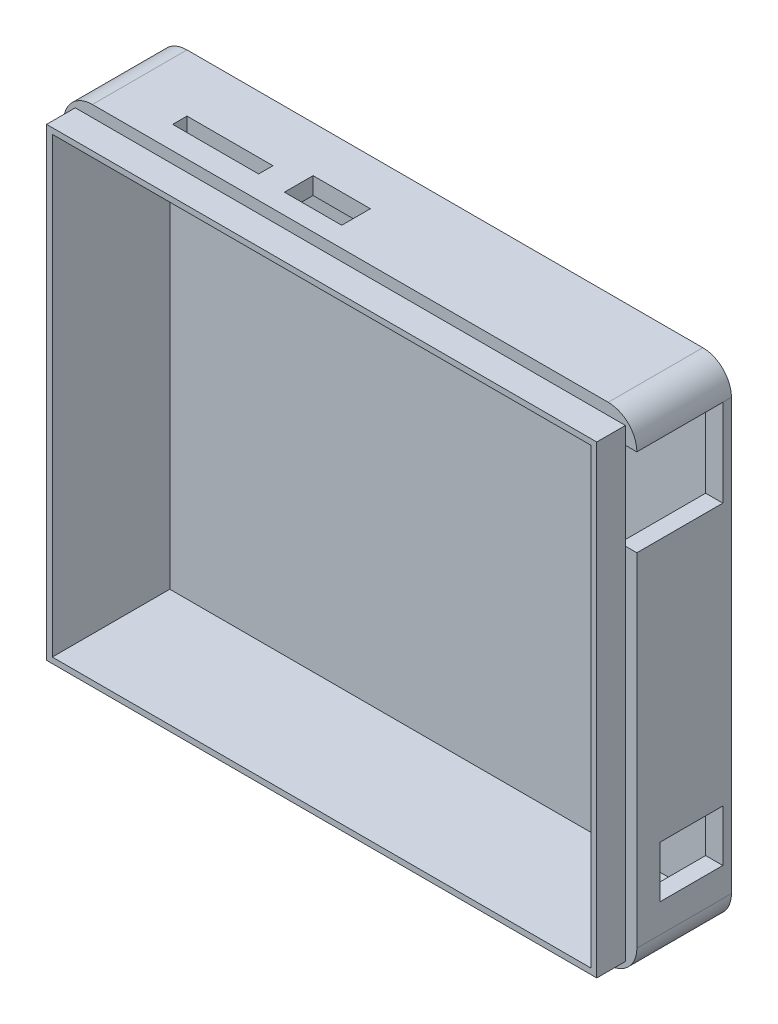
ISO-10303-21;
HEADER;
FILE_DESCRIPTION(('STEP AP214'),'2;1');
FILE_NAME('part.step','',(''),(''),'','','');
FILE_SCHEMA(('AUTOMOTIVE_DESIGN { 1 0 10303 214 1 1 1 1 }'));
ENDSEC;
DATA;
#1=APPLICATION_CONTEXT('core data for automotive mechanical design processes');
#2=APPLICATION_PROTOCOL_DEFINITION('international standard','automotive_design',2000,#1);
#3=PRODUCT_CONTEXT('',#1,'mechanical');
#4=PRODUCT('Part','Part','',(#3));
#5=PRODUCT_RELATED_PRODUCT_CATEGORY('part','',(#4));
#6=PRODUCT_DEFINITION_FORMATION('','',#4);
#7=PRODUCT_DEFINITION_CONTEXT('part definition',#1,'design');
#8=PRODUCT_DEFINITION('design','',#6,#7);
#9=PRODUCT_DEFINITION_SHAPE('','',#8);
#10=(LENGTH_UNIT() NAMED_UNIT(*) SI_UNIT(.MILLI.,.METRE.));
#11=(NAMED_UNIT(*) PLANE_ANGLE_UNIT() SI_UNIT($,.RADIAN.));
#12=(NAMED_UNIT(*) SI_UNIT($,.STERADIAN.) SOLID_ANGLE_UNIT());
#13=UNCERTAINTY_MEASURE_WITH_UNIT(LENGTH_MEASURE(1.E-05),#10,'distance_accuracy_value','');
#14=(GEOMETRIC_REPRESENTATION_CONTEXT(3) GLOBAL_UNCERTAINTY_ASSIGNED_CONTEXT((#13)) GLOBAL_UNIT_ASSIGNED_CONTEXT((#10,
#11,#12)) REPRESENTATION_CONTEXT('',''));
#15=CARTESIAN_POINT('',(0.,0.,0.));
#16=DIRECTION('',(0.,0.,1.));
#17=DIRECTION('',(1.,0.,0.));
#18=AXIS2_PLACEMENT_3D('',#15,#16,#17);
#19=CARTESIAN_POINT('',(50.,42.5,20.));
#20=DIRECTION('',(-1.,0.,0.));
#21=DIRECTION('',(0.,-1.,0.));
#22=AXIS2_PLACEMENT_3D('',#19,#20,#21);
#23=PLANE('',#22);
#24=DIRECTION('',(0.,0.,1.));
#25=VECTOR('',#24,1.);
#26=CARTESIAN_POINT('',(50.,-23.5,11.));
#27=LINE('',#26,#25);
#28=CARTESIAN_POINT('',(50.,-23.5,0.));
#29=VERTEX_POINT('',#28);
#30=CARTESIAN_POINT('',(50.,-23.5,11.));
#31=VERTEX_POINT('',#30);
#32=EDGE_CURVE('E326',#29,#31,#27,.T.);
#33=ORIENTED_EDGE('',*,*,#32,.F.);
#34=DIRECTION('',(0.,1.,0.));
#35=VECTOR('',#34,1.);
#36=CARTESIAN_POINT('',(50.,-23.5,0.));
#37=LINE('',#36,#35);
#38=CARTESIAN_POINT('',(50.,-32.5,0.));
#39=VERTEX_POINT('',#38);
#40=EDGE_CURVE('E324',#39,#29,#37,.T.);
#41=ORIENTED_EDGE('',*,*,#40,.F.);
#42=DIRECTION('',(0.,0.,-1.));
#43=VECTOR('',#42,1.);
#44=CARTESIAN_POINT('',(50.,-32.5,11.));
#45=LINE('',#44,#43);
#46=CARTESIAN_POINT('',(50.,-32.5,11.));
#47=VERTEX_POINT('',#46);
#48=EDGE_CURVE('E332',#47,#39,#45,.T.);
#49=ORIENTED_EDGE('',*,*,#48,.F.);
#50=DIRECTION('',(0.,-1.,0.));
#51=VECTOR('',#50,1.);
#52=CARTESIAN_POINT('',(50.,-23.5,11.));
#53=LINE('',#52,#51);
#54=EDGE_CURVE('E329',#31,#47,#53,.T.);
#55=ORIENTED_EDGE('',*,*,#54,.F.);
#56=EDGE_LOOP('',(#33,#41,#49,#55));
#57=FACE_BOUND('',#56,.T.);
#58=DIRECTION('',(0.,-1.,0.));
#59=VECTOR('',#58,1.);
#60=CARTESIAN_POINT('',(50.,42.5,-1.5));
#61=LINE('',#60,#59);
#62=CARTESIAN_POINT('',(50.,37.5,-1.5));
#63=VERTEX_POINT('',#62);
#64=CARTESIAN_POINT('',(50.,-37.5,-1.5));
#65=VERTEX_POINT('',#64);
#66=EDGE_CURVE('E362',#63,#65,#61,.T.);
#67=ORIENTED_EDGE('',*,*,#66,.F.);
#68=DIRECTION('',(0.,0.,-1.));
#69=VECTOR('',#68,1.);
#70=CARTESIAN_POINT('',(50.,37.5,20.));
#71=LINE('',#70,#69);
#72=CARTESIAN_POINT('',(50.,37.5,0.));
#73=VERTEX_POINT('',#72);
#74=EDGE_CURVE('E11',#63,#73,#71,.F.);
#75=ORIENTED_EDGE('',*,*,#74,.T.);
#76=DIRECTION('',(0.,1.,0.));
#77=VECTOR('',#76,1.);
#78=CARTESIAN_POINT('',(50.,37.5,0.));
#79=LINE('',#78,#77);
#80=CARTESIAN_POINT('',(50.,22.26,0.));
#81=VERTEX_POINT('',#80);
#82=EDGE_CURVE('E295',#81,#73,#79,.T.);
#83=ORIENTED_EDGE('',*,*,#82,.F.);
#84=DIRECTION('',(0.,0.,-1.));
#85=VECTOR('',#84,1.);
#86=CARTESIAN_POINT('',(50.,22.26,15.));
#87=LINE('',#86,#85);
#88=CARTESIAN_POINT('',(50.,22.26,15.));
#89=VERTEX_POINT('',#88);
#90=EDGE_CURVE('E306',#89,#81,#87,.T.);
#91=ORIENTED_EDGE('',*,*,#90,.F.);
#92=DIRECTION('',(0.,1.,0.));
#93=VECTOR('',#92,1.);
#94=CARTESIAN_POINT('',(50.,-42.5,15.));
#95=LINE('',#94,#93);
#96=CARTESIAN_POINT('',(50.,-37.5,15.));
#97=VERTEX_POINT('',#96);
#98=EDGE_CURVE('E416',#97,#89,#95,.T.);
#99=ORIENTED_EDGE('',*,*,#98,.F.);
#100=DIRECTION('',(0.,0.,-1.));
#101=VECTOR('',#100,1.);
#102=CARTESIAN_POINT('',(50.,-37.5,20.));
#103=LINE('',#102,#101);
#104=EDGE_CURVE('E41',#97,#65,#103,.T.);
#105=ORIENTED_EDGE('',*,*,#104,.T.);
#106=EDGE_LOOP('',(#67,#75,#83,#91,#99,#105));
#107=FACE_BOUND('',#106,.T.);
#108=ADVANCED_FACE('F33',(#57,#107),#23,.F.);
#109=CARTESIAN_POINT('',(-50.,42.5,20.));
#110=DIRECTION('',(0.,-1.,0.));
#111=DIRECTION('',(0.,0.,-1.));
#112=AXIS2_PLACEMENT_3D('',#109,#110,#111);
#113=PLANE('',#112);
#114=DIRECTION('',(-1.,0.,0.));
#115=VECTOR('',#114,1.);
#116=CARTESIAN_POINT('',(-15.,42.5,6.5));
#117=LINE('',#116,#115);
#118=CARTESIAN_POINT('',(-5.,42.5,6.5));
#119=VERTEX_POINT('',#118);
#120=CARTESIAN_POINT('',(-15.,42.5,6.5));
#121=VERTEX_POINT('',#120);
#122=EDGE_CURVE('E262',#119,#121,#117,.T.);
#123=ORIENTED_EDGE('',*,*,#122,.F.);
#124=DIRECTION('',(0.,0.,-1.));
#125=VECTOR('',#124,1.);
#126=CARTESIAN_POINT('',(-4.99999999999999,42.5,6.5));
#127=LINE('',#126,#125);
#128=CARTESIAN_POINT('',(-4.99999999999999,42.5,11.5));
#129=VERTEX_POINT('',#128);
#130=EDGE_CURVE('E267',#129,#119,#127,.T.);
#131=ORIENTED_EDGE('',*,*,#130,.F.);
#132=DIRECTION('',(1.,0.,0.));
#133=VECTOR('',#132,1.);
#134=CARTESIAN_POINT('',(-15.,42.5,11.5));
#135=LINE('',#134,#133);
#136=CARTESIAN_POINT('',(-15.,42.5,11.5));
#137=VERTEX_POINT('',#136);
#138=EDGE_CURVE('E272',#137,#129,#135,.T.);
#139=ORIENTED_EDGE('',*,*,#138,.F.);
#140=DIRECTION('',(0.,0.,1.));
#141=VECTOR('',#140,1.);
#142=CARTESIAN_POINT('',(-15.,42.5,6.5));
#143=LINE('',#142,#141);
#144=EDGE_CURVE('E251',#121,#137,#143,.T.);
#145=ORIENTED_EDGE('',*,*,#144,.F.);
#146=EDGE_LOOP('',(#123,#131,#139,#145));
#147=FACE_BOUND('',#146,.T.);
#148=DIRECTION('',(-1.,0.,0.));
#149=VECTOR('',#148,1.);
#150=CARTESIAN_POINT('',(-35.,42.5,8.5));
#151=LINE('',#150,#149);
#152=CARTESIAN_POINT('',(-20.,42.5,8.5));
#153=VERTEX_POINT('',#152);
#154=CARTESIAN_POINT('',(-35.,42.5,8.5));
#155=VERTEX_POINT('',#154);
#156=EDGE_CURVE('E283',#153,#155,#151,.T.);
#157=ORIENTED_EDGE('',*,*,#156,.F.);
#158=DIRECTION('',(0.,0.,-1.));
#159=VECTOR('',#158,1.);
#160=CARTESIAN_POINT('',(-20.,42.5,8.5));
#161=LINE('',#160,#159);
#162=CARTESIAN_POINT('',(-20.,42.5,11.));
#163=VERTEX_POINT('',#162);
#164=EDGE_CURVE('E279',#163,#153,#161,.T.);
#165=ORIENTED_EDGE('',*,*,#164,.F.);
#166=DIRECTION('',(1.,0.,0.));
#167=VECTOR('',#166,1.);
#168=CARTESIAN_POINT('',(-35.,42.5,11.));
#169=LINE('',#168,#167);
#170=CARTESIAN_POINT('',(-35.,42.5,11.));
#171=VERTEX_POINT('',#170);
#172=EDGE_CURVE('E289',#171,#163,#169,.T.);
#173=ORIENTED_EDGE('',*,*,#172,.F.);
#174=DIRECTION('',(0.,0.,1.));
#175=VECTOR('',#174,1.);
#176=CARTESIAN_POINT('',(-35.,42.5,8.5));
#177=LINE('',#176,#175);
#178=EDGE_CURVE('E286',#155,#171,#177,.T.);
#179=ORIENTED_EDGE('',*,*,#178,.F.);
#180=EDGE_LOOP('',(#157,#165,#173,#179));
#181=FACE_BOUND('',#180,.T.);
#182=DIRECTION('',(1.,0.,0.));
#183=VECTOR('',#182,1.);
#184=CARTESIAN_POINT('',(50.,42.5,-1.5));
#185=LINE('',#184,#183);
#186=CARTESIAN_POINT('',(-45.,42.5,-1.5));
#187=VERTEX_POINT('',#186);
#188=CARTESIAN_POINT('',(45.,42.5,-1.5));
#189=VERTEX_POINT('',#188);
#190=EDGE_CURVE('E359',#187,#189,#185,.T.);
#191=ORIENTED_EDGE('',*,*,#190,.F.);
#192=DIRECTION('',(0.,0.,-1.));
#193=VECTOR('',#192,1.);
#194=CARTESIAN_POINT('',(-45.,42.5,20.));
#195=LINE('',#194,#193);
#196=CARTESIAN_POINT('',(-45.,42.5,15.));
#197=VERTEX_POINT('',#196);
#198=EDGE_CURVE('E492',#187,#197,#195,.F.);
#199=ORIENTED_EDGE('',*,*,#198,.T.);
#200=DIRECTION('',(-1.,0.,0.));
#201=VECTOR('',#200,1.);
#202=CARTESIAN_POINT('',(-50.,42.5,15.));
#203=LINE('',#202,#201);
#204=CARTESIAN_POINT('',(45.,42.5,15.));
#205=VERTEX_POINT('',#204);
#206=EDGE_CURVE('E424',#205,#197,#203,.T.);
#207=ORIENTED_EDGE('',*,*,#206,.F.);
#208=DIRECTION('',(0.,0.,-1.));
#209=VECTOR('',#208,1.);
#210=CARTESIAN_POINT('',(45.,42.5,20.));
#211=LINE('',#210,#209);
#212=EDGE_CURVE('E489',#205,#189,#211,.T.);
#213=ORIENTED_EDGE('',*,*,#212,.T.);
#214=EDGE_LOOP('',(#191,#199,#207,#213));
#215=FACE_BOUND('',#214,.T.);
#216=ADVANCED_FACE('F269',(#147,#181,#215),#113,.F.);
#217=CARTESIAN_POINT('',(-50.,42.5,20.));
#218=DIRECTION('',(1.,0.,0.));
#219=DIRECTION('',(0.,1.,0.));
#220=AXIS2_PLACEMENT_3D('',#217,#218,#219);
#221=PLANE('',#220);
#222=DIRECTION('',(0.,-1.,0.));
#223=VECTOR('',#222,1.);
#224=CARTESIAN_POINT('',(-50.,-42.5,15.));
#225=LINE('',#224,#223);
#226=CARTESIAN_POINT('',(-50.,37.5,15.));
#227=VERTEX_POINT('',#226);
#228=CARTESIAN_POINT('',(-50.,-37.5,15.));
#229=VERTEX_POINT('',#228);
#230=EDGE_CURVE('E427',#227,#229,#225,.T.);
#231=ORIENTED_EDGE('',*,*,#230,.F.);
#232=DIRECTION('',(0.,0.,-1.));
#233=VECTOR('',#232,1.);
#234=CARTESIAN_POINT('',(-50.,37.5,20.));
#235=LINE('',#234,#233);
#236=CARTESIAN_POINT('',(-50.,37.5,-1.5));
#237=VERTEX_POINT('',#236);
#238=EDGE_CURVE('E478',#227,#237,#235,.T.);
#239=ORIENTED_EDGE('',*,*,#238,.T.);
#240=DIRECTION('',(0.,1.,0.));
#241=VECTOR('',#240,1.);
#242=CARTESIAN_POINT('',(-50.,42.5,-1.5));
#243=LINE('',#242,#241);
#244=CARTESIAN_POINT('',(-50.,-37.5,-1.5));
#245=VERTEX_POINT('',#244);
#246=EDGE_CURVE('E356',#245,#237,#243,.T.);
#247=ORIENTED_EDGE('',*,*,#246,.F.);
#248=DIRECTION('',(0.,0.,-1.));
#249=VECTOR('',#248,1.);
#250=CARTESIAN_POINT('',(-50.,-37.5,20.));
#251=LINE('',#250,#249);
#252=EDGE_CURVE('E476',#245,#229,#251,.F.);
#253=ORIENTED_EDGE('',*,*,#252,.T.);
#254=EDGE_LOOP('',(#231,#239,#247,#253));
#255=FACE_BOUND('',#254,.T.);
#256=ADVANCED_FACE('F532',(#255),#221,.F.);
#257=CARTESIAN_POINT('',(-50.,-42.5,20.));
#258=DIRECTION('',(0.,1.,0.));
#259=DIRECTION('',(0.,0.,1.));
#260=AXIS2_PLACEMENT_3D('',#257,#258,#259);
#261=PLANE('',#260);
#262=DIRECTION('',(1.,0.,0.));
#263=VECTOR('',#262,1.);
#264=CARTESIAN_POINT('',(-50.,-42.5,15.));
#265=LINE('',#264,#263);
#266=CARTESIAN_POINT('',(-45.,-42.5,15.));
#267=VERTEX_POINT('',#266);
#268=CARTESIAN_POINT('',(45.,-42.5,15.));
#269=VERTEX_POINT('',#268);
#270=EDGE_CURVE('E429',#267,#269,#265,.T.);
#271=ORIENTED_EDGE('',*,*,#270,.F.);
#272=DIRECTION('',(0.,0.,-1.));
#273=VECTOR('',#272,1.);
#274=CARTESIAN_POINT('',(-45.,-42.5,20.));
#275=LINE('',#274,#273);
#276=CARTESIAN_POINT('',(-45.,-42.5,-1.5));
#277=VERTEX_POINT('',#276);
#278=EDGE_CURVE('E502',#267,#277,#275,.T.);
#279=ORIENTED_EDGE('',*,*,#278,.T.);
#280=DIRECTION('',(-1.,0.,0.));
#281=VECTOR('',#280,1.);
#282=CARTESIAN_POINT('',(50.,-42.5,-1.5));
#283=LINE('',#282,#281);
#284=CARTESIAN_POINT('',(45.,-42.5,-1.5));
#285=VERTEX_POINT('',#284);
#286=EDGE_CURVE('E365',#285,#277,#283,.T.);
#287=ORIENTED_EDGE('',*,*,#286,.F.);
#288=DIRECTION('',(0.,0.,-1.));
#289=VECTOR('',#288,1.);
#290=CARTESIAN_POINT('',(45.,-42.5,20.));
#291=LINE('',#290,#289);
#292=EDGE_CURVE('E48',#285,#269,#291,.F.);
#293=ORIENTED_EDGE('',*,*,#292,.T.);
#294=EDGE_LOOP('',(#271,#279,#287,#293));
#295=FACE_BOUND('',#294,.T.);
#296=ADVANCED_FACE('F537',(#295),#261,.F.);
#297=CARTESIAN_POINT('',(0.,0.,15.));
#298=DIRECTION('',(0.,0.,-1.));
#299=DIRECTION('',(-1.,0.,0.));
#300=AXIS2_PLACEMENT_3D('',#297,#298,#299);
#301=PLANE('',#300);
#302=ORIENTED_EDGE('',*,*,#206,.T.);
#303=CARTESIAN_POINT('',(-45.,37.5,15.));
#304=DIRECTION('',(0.,0.,-1.));
#305=DIRECTION('',(-1.,0.,0.));
#306=AXIS2_PLACEMENT_3D('',#303,#304,#305);
#307=CIRCLE('',#306,5.);
#308=EDGE_CURVE('E499',#197,#227,#307,.F.);
#309=ORIENTED_EDGE('',*,*,#308,.T.);
#310=ORIENTED_EDGE('',*,*,#230,.T.);
#311=CARTESIAN_POINT('',(-45.,-37.5,15.));
#312=DIRECTION('',(0.,0.,-1.));
#313=DIRECTION('',(-1.,0.,0.));
#314=AXIS2_PLACEMENT_3D('',#311,#312,#313);
#315=CIRCLE('',#314,5.);
#316=EDGE_CURVE('E55',#229,#267,#315,.F.);
#317=ORIENTED_EDGE('',*,*,#316,.T.);
#318=ORIENTED_EDGE('',*,*,#270,.T.);
#319=CARTESIAN_POINT('',(45.,-37.5,15.));
#320=DIRECTION('',(0.,0.,-1.));
#321=DIRECTION('',(-1.,0.,0.));
#322=AXIS2_PLACEMENT_3D('',#319,#320,#321);
#323=CIRCLE('',#322,5.);
#324=EDGE_CURVE('E494',#269,#97,#323,.F.);
#325=ORIENTED_EDGE('',*,*,#324,.T.);
#326=ORIENTED_EDGE('',*,*,#98,.T.);
#327=DIRECTION('',(1.,0.,0.));
#328=VECTOR('',#327,1.);
#329=CARTESIAN_POINT('',(0.,22.26,15.));
#330=LINE('',#329,#328);
#331=CARTESIAN_POINT('',(48.,22.26,15.));
#332=VERTEX_POINT('',#331);
#333=EDGE_CURVE('E314',#332,#89,#330,.T.);
#334=ORIENTED_EDGE('',*,*,#333,.F.);
#335=DIRECTION('',(0.,1.,0.));
#336=VECTOR('',#335,1.);
#337=CARTESIAN_POINT('',(48.,40.5,15.));
#338=LINE('',#337,#336);
#339=CARTESIAN_POINT('',(48.,-40.5,15.));
#340=VERTEX_POINT('',#339);
#341=EDGE_CURVE('E389',#340,#332,#338,.T.);
#342=ORIENTED_EDGE('',*,*,#341,.F.);
#343=DIRECTION('',(1.,0.,0.));
#344=VECTOR('',#343,1.);
#345=CARTESIAN_POINT('',(-48.,-40.5,15.));
#346=LINE('',#345,#344);
#347=CARTESIAN_POINT('',(-48.,-40.5,15.));
#348=VERTEX_POINT('',#347);
#349=EDGE_CURVE('E399',#348,#340,#346,.T.);
#350=ORIENTED_EDGE('',*,*,#349,.F.);
#351=DIRECTION('',(0.,-1.,0.));
#352=VECTOR('',#351,1.);
#353=CARTESIAN_POINT('',(-48.,40.5,15.));
#354=LINE('',#353,#352);
#355=CARTESIAN_POINT('',(-48.,40.5,15.));
#356=VERTEX_POINT('',#355);
#357=EDGE_CURVE('E396',#356,#348,#354,.T.);
#358=ORIENTED_EDGE('',*,*,#357,.F.);
#359=DIRECTION('',(-1.,0.,0.));
#360=VECTOR('',#359,1.);
#361=CARTESIAN_POINT('',(-48.,40.5,15.));
#362=LINE('',#361,#360);
#363=CARTESIAN_POINT('',(48.,40.5,15.));
#364=VERTEX_POINT('',#363);
#365=EDGE_CURVE('E392',#364,#356,#362,.T.);
#366=ORIENTED_EDGE('',*,*,#365,.F.);
#367=CARTESIAN_POINT('',(48.,37.5,15.));
#368=VERTEX_POINT('',#367);
#369=EDGE_CURVE('E393',#368,#364,#338,.T.);
#370=ORIENTED_EDGE('',*,*,#369,.F.);
#371=DIRECTION('',(1.,0.,0.));
#372=VECTOR('',#371,1.);
#373=CARTESIAN_POINT('',(0.,37.5,15.));
#374=LINE('',#373,#372);
#375=CARTESIAN_POINT('',(50.,37.5,15.));
#376=VERTEX_POINT('',#375);
#377=EDGE_CURVE('E318',#368,#376,#374,.T.);
#378=ORIENTED_EDGE('',*,*,#377,.T.);
#379=CARTESIAN_POINT('',(45.,37.5,15.));
#380=DIRECTION('',(0.,0.,-1.));
#381=DIRECTION('',(-1.,0.,0.));
#382=AXIS2_PLACEMENT_3D('',#379,#380,#381);
#383=CIRCLE('',#382,5.);
#384=EDGE_CURVE('E496',#376,#205,#383,.F.);
#385=ORIENTED_EDGE('',*,*,#384,.T.);
#386=EDGE_LOOP('',(#302,#309,#310,#317,#318,#325,#326,#334,#342,#350,#358,#366,#370,#378,#385));
#387=FACE_BOUND('',#386,.T.);
#388=ADVANCED_FACE('F525',(#387),#301,.F.);
#389=CARTESIAN_POINT('',(48.,40.5,15.));
#390=DIRECTION('',(1.,0.,0.));
#391=DIRECTION('',(0.,1.,0.));
#392=AXIS2_PLACEMENT_3D('',#389,#390,#391);
#393=PLANE('',#392);
#394=DIRECTION('',(0.,1.,0.));
#395=VECTOR('',#394,1.);
#396=CARTESIAN_POINT('',(48.,40.5,20.));
#397=LINE('',#396,#395);
#398=CARTESIAN_POINT('',(48.,-40.5,20.));
#399=VERTEX_POINT('',#398);
#400=CARTESIAN_POINT('',(48.,40.5,20.));
#401=VERTEX_POINT('',#400);
#402=EDGE_CURVE('E382',#399,#401,#397,.T.);
#403=ORIENTED_EDGE('',*,*,#402,.F.);
#404=DIRECTION('',(0.,0.,1.));
#405=VECTOR('',#404,1.);
#406=CARTESIAN_POINT('',(48.,-40.5,15.));
#407=LINE('',#406,#405);
#408=EDGE_CURVE('E414',#340,#399,#407,.T.);
#409=ORIENTED_EDGE('',*,*,#408,.F.);
#410=ORIENTED_EDGE('',*,*,#341,.T.);
#411=DIRECTION('',(0.,-1.,0.));
#412=VECTOR('',#411,1.);
#413=CARTESIAN_POINT('',(48.,40.5,15.));
#414=LINE('',#413,#412);
#415=EDGE_CURVE('E312',#368,#332,#414,.T.);
#416=ORIENTED_EDGE('',*,*,#415,.F.);
#417=ORIENTED_EDGE('',*,*,#369,.T.);
#418=DIRECTION('',(0.,0.,1.));
#419=VECTOR('',#418,1.);
#420=CARTESIAN_POINT('',(48.,40.5,15.));
#421=LINE('',#420,#419);
#422=EDGE_CURVE('E402',#364,#401,#421,.T.);
#423=ORIENTED_EDGE('',*,*,#422,.T.);
#424=EDGE_LOOP('',(#403,#409,#410,#416,#417,#423));
#425=FACE_BOUND('',#424,.T.);
#426=ADVANCED_FACE('F827',(#425),#393,.T.);
#427=CARTESIAN_POINT('',(-48.,-40.5,15.));
#428=DIRECTION('',(0.,-1.,0.));
#429=DIRECTION('',(0.,0.,-1.));
#430=AXIS2_PLACEMENT_3D('',#427,#428,#429);
#431=PLANE('',#430);
#432=DIRECTION('',(1.,0.,0.));
#433=VECTOR('',#432,1.);
#434=CARTESIAN_POINT('',(-48.,-40.5,20.));
#435=LINE('',#434,#433);
#436=CARTESIAN_POINT('',(-48.,-40.5,20.));
#437=VERTEX_POINT('',#436);
#438=EDGE_CURVE('E411',#437,#399,#435,.T.);
#439=ORIENTED_EDGE('',*,*,#438,.F.);
#440=DIRECTION('',(0.,0.,1.));
#441=VECTOR('',#440,1.);
#442=CARTESIAN_POINT('',(-48.,-40.5,15.));
#443=LINE('',#442,#441);
#444=EDGE_CURVE('E417',#348,#437,#443,.T.);
#445=ORIENTED_EDGE('',*,*,#444,.F.);
#446=ORIENTED_EDGE('',*,*,#349,.T.);
#447=ORIENTED_EDGE('',*,*,#408,.T.);
#448=EDGE_LOOP('',(#439,#445,#446,#447));
#449=FACE_BOUND('',#448,.T.);
#450=ADVANCED_FACE('F833',(#449),#431,.T.);
#451=CARTESIAN_POINT('',(-48.,40.5,15.));
#452=DIRECTION('',(-1.,0.,0.));
#453=DIRECTION('',(0.,-1.,0.));
#454=AXIS2_PLACEMENT_3D('',#451,#452,#453);
#455=PLANE('',#454);
#456=DIRECTION('',(0.,-1.,0.));
#457=VECTOR('',#456,1.);
#458=CARTESIAN_POINT('',(-48.,40.5,20.));
#459=LINE('',#458,#457);
#460=CARTESIAN_POINT('',(-48.,40.5,20.));
#461=VERTEX_POINT('',#460);
#462=EDGE_CURVE('E408',#461,#437,#459,.T.);
#463=ORIENTED_EDGE('',*,*,#462,.F.);
#464=DIRECTION('',(0.,0.,1.));
#465=VECTOR('',#464,1.);
#466=CARTESIAN_POINT('',(-48.,40.5,15.));
#467=LINE('',#466,#465);
#468=EDGE_CURVE('E419',#356,#461,#467,.T.);
#469=ORIENTED_EDGE('',*,*,#468,.F.);
#470=ORIENTED_EDGE('',*,*,#357,.T.);
#471=ORIENTED_EDGE('',*,*,#444,.T.);
#472=EDGE_LOOP('',(#463,#469,#470,#471));
#473=FACE_BOUND('',#472,.T.);
#474=ADVANCED_FACE('F841',(#473),#455,.T.);
#475=CARTESIAN_POINT('',(-48.,40.5,15.));
#476=DIRECTION('',(0.,1.,0.));
#477=DIRECTION('',(0.,0.,1.));
#478=AXIS2_PLACEMENT_3D('',#475,#476,#477);
#479=PLANE('',#478);
#480=DIRECTION('',(-1.,0.,0.));
#481=VECTOR('',#480,1.);
#482=CARTESIAN_POINT('',(-48.,40.5,20.));
#483=LINE('',#482,#481);
#484=EDGE_CURVE('E405',#401,#461,#483,.T.);
#485=ORIENTED_EDGE('',*,*,#484,.F.);
#486=ORIENTED_EDGE('',*,*,#422,.F.);
#487=ORIENTED_EDGE('',*,*,#365,.T.);
#488=ORIENTED_EDGE('',*,*,#468,.T.);
#489=EDGE_LOOP('',(#485,#486,#487,#488));
#490=FACE_BOUND('',#489,.T.);
#491=ADVANCED_FACE('F849',(#490),#479,.T.);
#492=CARTESIAN_POINT('',(0.,0.,20.));
#493=DIRECTION('',(0.,0.,1.));
#494=DIRECTION('',(1.,0.,0.));
#495=AXIS2_PLACEMENT_3D('',#492,#493,#494);
#496=PLANE('',#495);
#497=DIRECTION('',(0.,1.,0.));
#498=VECTOR('',#497,1.);
#499=CARTESIAN_POINT('',(47.,39.5,20.));
#500=LINE('',#499,#498);
#501=CARTESIAN_POINT('',(47.,-39.5,20.));
#502=VERTEX_POINT('',#501);
#503=CARTESIAN_POINT('',(47.,39.5,20.));
#504=VERTEX_POINT('',#503);
#505=EDGE_CURVE('E368',#502,#504,#500,.T.);
#506=ORIENTED_EDGE('',*,*,#505,.F.);
#507=DIRECTION('',(1.,0.,0.));
#508=VECTOR('',#507,1.);
#509=CARTESIAN_POINT('',(-47.,-39.5,20.));
#510=LINE('',#509,#508);
#511=CARTESIAN_POINT('',(-47.,-39.5,20.));
#512=VERTEX_POINT('',#511);
#513=EDGE_CURVE('E376',#512,#502,#510,.T.);
#514=ORIENTED_EDGE('',*,*,#513,.F.);
#515=DIRECTION('',(0.,-1.,0.));
#516=VECTOR('',#515,1.);
#517=CARTESIAN_POINT('',(-47.,39.5,20.));
#518=LINE('',#517,#516);
#519=CARTESIAN_POINT('',(-47.,39.5,20.));
#520=VERTEX_POINT('',#519);
#521=EDGE_CURVE('E373',#520,#512,#518,.T.);
#522=ORIENTED_EDGE('',*,*,#521,.F.);
#523=DIRECTION('',(-1.,0.,0.));
#524=VECTOR('',#523,1.);
#525=CARTESIAN_POINT('',(-47.,39.5,20.));
#526=LINE('',#525,#524);
#527=EDGE_CURVE('E370',#504,#520,#526,.T.);
#528=ORIENTED_EDGE('',*,*,#527,.F.);
#529=EDGE_LOOP('',(#506,#514,#522,#528));
#530=FACE_BOUND('',#529,.T.);
#531=ORIENTED_EDGE('',*,*,#438,.T.);
#532=ORIENTED_EDGE('',*,*,#402,.T.);
#533=ORIENTED_EDGE('',*,*,#484,.T.);
#534=ORIENTED_EDGE('',*,*,#462,.T.);
#535=EDGE_LOOP('',(#531,#532,#533,#534));
#536=FACE_BOUND('',#535,.T.);
#537=ADVANCED_FACE('F774',(#530,#536),#496,.T.);
#538=CARTESIAN_POINT('',(47.,39.5,1.));
#539=DIRECTION('',(1.,0.,0.));
#540=DIRECTION('',(0.,1.,0.));
#541=AXIS2_PLACEMENT_3D('',#538,#539,#540);
#542=PLANE('',#541);
#543=DIRECTION('',(0.,0.,-1.));
#544=VECTOR('',#543,1.);
#545=CARTESIAN_POINT('',(47.,22.26,1.));
#546=LINE('',#545,#544);
#547=CARTESIAN_POINT('',(47.,22.26,15.));
#548=VERTEX_POINT('',#547);
#549=CARTESIAN_POINT('',(47.,22.26,0.));
#550=VERTEX_POINT('',#549);
#551=EDGE_CURVE('E449',#548,#550,#546,.T.);
#552=ORIENTED_EDGE('',*,*,#551,.T.);
#553=DIRECTION('',(0.,1.,0.));
#554=VECTOR('',#553,1.);
#555=CARTESIAN_POINT('',(47.,39.5,0.));
#556=LINE('',#555,#554);
#557=CARTESIAN_POINT('',(47.,37.5,0.));
#558=VERTEX_POINT('',#557);
#559=EDGE_CURVE('E452',#550,#558,#556,.T.);
#560=ORIENTED_EDGE('',*,*,#559,.T.);
#561=DIRECTION('',(0.,0.,1.));
#562=VECTOR('',#561,1.);
#563=CARTESIAN_POINT('',(47.,37.5,1.));
#564=LINE('',#563,#562);
#565=CARTESIAN_POINT('',(47.,37.5,15.));
#566=VERTEX_POINT('',#565);
#567=EDGE_CURVE('E443',#558,#566,#564,.T.);
#568=ORIENTED_EDGE('',*,*,#567,.T.);
#569=DIRECTION('',(0.,-1.,0.));
#570=VECTOR('',#569,1.);
#571=CARTESIAN_POINT('',(47.,39.5,15.));
#572=LINE('',#571,#570);
#573=EDGE_CURVE('E446',#566,#548,#572,.T.);
#574=ORIENTED_EDGE('',*,*,#573,.T.);
#575=EDGE_LOOP('',(#552,#560,#568,#574));
#576=FACE_BOUND('',#575,.T.);
#577=DIRECTION('',(0.,0.,-1.));
#578=VECTOR('',#577,1.);
#579=CARTESIAN_POINT('',(47.,-32.5,1.));
#580=LINE('',#579,#578);
#581=CARTESIAN_POINT('',(47.,-32.5,11.));
#582=VERTEX_POINT('',#581);
#583=CARTESIAN_POINT('',(47.,-32.5,0.));
#584=VERTEX_POINT('',#583);
#585=EDGE_CURVE('E437',#582,#584,#580,.T.);
#586=ORIENTED_EDGE('',*,*,#585,.T.);
#587=DIRECTION('',(0.,1.,0.));
#588=VECTOR('',#587,1.);
#589=CARTESIAN_POINT('',(47.,39.5,0.));
#590=LINE('',#589,#588);
#591=CARTESIAN_POINT('',(47.,-23.5,0.));
#592=VERTEX_POINT('',#591);
#593=EDGE_CURVE('E440',#584,#592,#590,.T.);
#594=ORIENTED_EDGE('',*,*,#593,.T.);
#595=DIRECTION('',(0.,0.,1.));
#596=VECTOR('',#595,1.);
#597=CARTESIAN_POINT('',(47.,-23.5,0.999999999999981));
#598=LINE('',#597,#596);
#599=CARTESIAN_POINT('',(47.,-23.5,11.));
#600=VERTEX_POINT('',#599);
#601=EDGE_CURVE('E431',#592,#600,#598,.T.);
#602=ORIENTED_EDGE('',*,*,#601,.T.);
#603=DIRECTION('',(0.,-1.,0.));
#604=VECTOR('',#603,1.);
#605=CARTESIAN_POINT('',(47.,39.5,11.));
#606=LINE('',#605,#604);
#607=EDGE_CURVE('E434',#600,#582,#606,.T.);
#608=ORIENTED_EDGE('',*,*,#607,.T.);
#609=EDGE_LOOP('',(#586,#594,#602,#608));
#610=FACE_BOUND('',#609,.T.);
#611=ORIENTED_EDGE('',*,*,#505,.T.);
#612=DIRECTION('',(0.,0.,1.));
#613=VECTOR('',#612,1.);
#614=CARTESIAN_POINT('',(47.,39.5,1.));
#615=LINE('',#614,#613);
#616=CARTESIAN_POINT('',(47.,39.5,-0.499999999999999));
#617=VERTEX_POINT('',#616);
#618=EDGE_CURVE('E379',#617,#504,#615,.T.);
#619=ORIENTED_EDGE('',*,*,#618,.F.);
#620=DIRECTION('',(0.,1.,0.));
#621=VECTOR('',#620,1.);
#622=CARTESIAN_POINT('',(47.,-39.5,-0.499999999999999));
#623=LINE('',#622,#621);
#624=CARTESIAN_POINT('',(47.,-39.5,-0.499999999999999));
#625=VERTEX_POINT('',#624);
#626=EDGE_CURVE('E338',#625,#617,#623,.T.);
#627=ORIENTED_EDGE('',*,*,#626,.F.);
#628=DIRECTION('',(0.,0.,1.));
#629=VECTOR('',#628,1.);
#630=CARTESIAN_POINT('',(47.,-39.5,1.));
#631=LINE('',#630,#629);
#632=EDGE_CURVE('E380',#625,#502,#631,.T.);
#633=ORIENTED_EDGE('',*,*,#632,.T.);
#634=EDGE_LOOP('',(#611,#619,#627,#633));
#635=FACE_BOUND('',#634,.T.);
#636=ADVANCED_FACE('F762',(#576,#610,#635),#542,.F.);
#637=CARTESIAN_POINT('',(-47.,-39.5,1.));
#638=DIRECTION('',(0.,-1.,0.));
#639=DIRECTION('',(0.,0.,-1.));
#640=AXIS2_PLACEMENT_3D('',#637,#638,#639);
#641=PLANE('',#640);
#642=ORIENTED_EDGE('',*,*,#513,.T.);
#643=ORIENTED_EDGE('',*,*,#632,.F.);
#644=DIRECTION('',(1.,0.,0.));
#645=VECTOR('',#644,1.);
#646=CARTESIAN_POINT('',(-47.,-39.5,-0.499999999999999));
#647=LINE('',#646,#645);
#648=CARTESIAN_POINT('',(-47.,-39.5,-0.499999999999999));
#649=VERTEX_POINT('',#648);
#650=EDGE_CURVE('E353',#649,#625,#647,.T.);
#651=ORIENTED_EDGE('',*,*,#650,.F.);
#652=DIRECTION('',(0.,0.,1.));
#653=VECTOR('',#652,1.);
#654=CARTESIAN_POINT('',(-47.,-39.5,1.));
#655=LINE('',#654,#653);
#656=EDGE_CURVE('E383',#649,#512,#655,.T.);
#657=ORIENTED_EDGE('',*,*,#656,.T.);
#658=EDGE_LOOP('',(#642,#643,#651,#657));
#659=FACE_BOUND('',#658,.T.);
#660=ADVANCED_FACE('F750',(#659),#641,.F.);
#661=CARTESIAN_POINT('',(-47.,39.5,1.));
#662=DIRECTION('',(-1.,0.,0.));
#663=DIRECTION('',(0.,-1.,0.));
#664=AXIS2_PLACEMENT_3D('',#661,#662,#663);
#665=PLANE('',#664);
#666=ORIENTED_EDGE('',*,*,#521,.T.);
#667=ORIENTED_EDGE('',*,*,#656,.F.);
#668=DIRECTION('',(0.,-1.,0.));
#669=VECTOR('',#668,1.);
#670=CARTESIAN_POINT('',(-47.,-39.5,-0.499999999999999));
#671=LINE('',#670,#669);
#672=CARTESIAN_POINT('',(-47.,39.5,-0.499999999999999));
#673=VERTEX_POINT('',#672);
#674=EDGE_CURVE('E350',#673,#649,#671,.T.);
#675=ORIENTED_EDGE('',*,*,#674,.F.);
#676=DIRECTION('',(0.,0.,1.));
#677=VECTOR('',#676,1.);
#678=CARTESIAN_POINT('',(-47.,39.5,1.));
#679=LINE('',#678,#677);
#680=EDGE_CURVE('E385',#673,#520,#679,.T.);
#681=ORIENTED_EDGE('',*,*,#680,.T.);
#682=EDGE_LOOP('',(#666,#667,#675,#681));
#683=FACE_BOUND('',#682,.T.);
#684=ADVANCED_FACE('F738',(#683),#665,.F.);
#685=CARTESIAN_POINT('',(-47.,39.5,1.));
#686=DIRECTION('',(0.,1.,0.));
#687=DIRECTION('',(0.,0.,1.));
#688=AXIS2_PLACEMENT_3D('',#685,#686,#687);
#689=PLANE('',#688);
#690=DIRECTION('',(1.,0.,0.));
#691=VECTOR('',#690,1.);
#692=CARTESIAN_POINT('',(-47.,39.5,11.5));
#693=LINE('',#692,#691);
#694=CARTESIAN_POINT('',(-15.,39.5,11.5));
#695=VERTEX_POINT('',#694);
#696=CARTESIAN_POINT('',(-4.99999999999999,39.5,11.5));
#697=VERTEX_POINT('',#696);
#698=EDGE_CURVE('E470',#695,#697,#693,.T.);
#699=ORIENTED_EDGE('',*,*,#698,.T.);
#700=DIRECTION('',(0.,0.,-1.));
#701=VECTOR('',#700,1.);
#702=CARTESIAN_POINT('',(-4.99999999999999,39.5,1.));
#703=LINE('',#702,#701);
#704=CARTESIAN_POINT('',(-4.99999999999999,39.5,6.5));
#705=VERTEX_POINT('',#704);
#706=EDGE_CURVE('E473',#697,#705,#703,.T.);
#707=ORIENTED_EDGE('',*,*,#706,.T.);
#708=DIRECTION('',(-1.,0.,0.));
#709=VECTOR('',#708,1.);
#710=CARTESIAN_POINT('',(-47.,39.5,6.5));
#711=LINE('',#710,#709);
#712=CARTESIAN_POINT('',(-15.,39.5,6.5));
#713=VERTEX_POINT('',#712);
#714=EDGE_CURVE('E467',#705,#713,#711,.T.);
#715=ORIENTED_EDGE('',*,*,#714,.T.);
#716=DIRECTION('',(0.,0.,1.));
#717=VECTOR('',#716,1.);
#718=CARTESIAN_POINT('',(-15.,39.5,1.));
#719=LINE('',#718,#717);
#720=EDGE_CURVE('E254',#713,#695,#719,.T.);
#721=ORIENTED_EDGE('',*,*,#720,.T.);
#722=EDGE_LOOP('',(#699,#707,#715,#721));
#723=FACE_BOUND('',#722,.T.);
#724=DIRECTION('',(1.,0.,0.));
#725=VECTOR('',#724,1.);
#726=CARTESIAN_POINT('',(-47.,39.5,11.));
#727=LINE('',#726,#725);
#728=CARTESIAN_POINT('',(-35.,39.5,11.));
#729=VERTEX_POINT('',#728);
#730=CARTESIAN_POINT('',(-20.,39.5,11.));
#731=VERTEX_POINT('',#730);
#732=EDGE_CURVE('E461',#729,#731,#727,.T.);
#733=ORIENTED_EDGE('',*,*,#732,.T.);
#734=DIRECTION('',(0.,0.,-1.));
#735=VECTOR('',#734,1.);
#736=CARTESIAN_POINT('',(-20.,39.5,1.));
#737=LINE('',#736,#735);
#738=CARTESIAN_POINT('',(-20.,39.5,8.5));
#739=VERTEX_POINT('',#738);
#740=EDGE_CURVE('E464',#731,#739,#737,.T.);
#741=ORIENTED_EDGE('',*,*,#740,.T.);
#742=DIRECTION('',(-1.,0.,0.));
#743=VECTOR('',#742,1.);
#744=CARTESIAN_POINT('',(-47.,39.5,8.5));
#745=LINE('',#744,#743);
#746=CARTESIAN_POINT('',(-35.,39.5,8.5));
#747=VERTEX_POINT('',#746);
#748=EDGE_CURVE('E455',#739,#747,#745,.T.);
#749=ORIENTED_EDGE('',*,*,#748,.T.);
#750=DIRECTION('',(0.,0.,1.));
#751=VECTOR('',#750,1.);
#752=CARTESIAN_POINT('',(-35.,39.5,1.00000000000003));
#753=LINE('',#752,#751);
#754=EDGE_CURVE('E458',#747,#729,#753,.T.);
#755=ORIENTED_EDGE('',*,*,#754,.T.);
#756=EDGE_LOOP('',(#733,#741,#749,#755));
#757=FACE_BOUND('',#756,.T.);
#758=ORIENTED_EDGE('',*,*,#527,.T.);
#759=ORIENTED_EDGE('',*,*,#680,.F.);
#760=DIRECTION('',(-1.,0.,0.));
#761=VECTOR('',#760,1.);
#762=CARTESIAN_POINT('',(-47.,39.5,-0.499999999999999));
#763=LINE('',#762,#761);
#764=EDGE_CURVE('E347',#617,#673,#763,.T.);
#765=ORIENTED_EDGE('',*,*,#764,.F.);
#766=ORIENTED_EDGE('',*,*,#618,.T.);
#767=EDGE_LOOP('',(#758,#759,#765,#766));
#768=FACE_BOUND('',#767,.T.);
#769=ADVANCED_FACE('F732',(#723,#757,#768),#689,.F.);
#770=CARTESIAN_POINT('',(0.,0.,-1.5));
#771=DIRECTION('',(0.,0.,-1.));
#772=DIRECTION('',(-1.,0.,0.));
#773=AXIS2_PLACEMENT_3D('',#770,#771,#772);
#774=PLANE('',#773);
#775=ORIENTED_EDGE('',*,*,#246,.T.);
#776=CARTESIAN_POINT('',(-45.,37.5,-1.5));
#777=DIRECTION('',(0.,0.,-1.));
#778=DIRECTION('',(-1.,0.,0.));
#779=AXIS2_PLACEMENT_3D('',#776,#777,#778);
#780=CIRCLE('',#779,5.);
#781=EDGE_CURVE('E487',#237,#187,#780,.T.);
#782=ORIENTED_EDGE('',*,*,#781,.T.);
#783=ORIENTED_EDGE('',*,*,#190,.T.);
#784=CARTESIAN_POINT('',(45.,37.5,-1.5));
#785=DIRECTION('',(0.,0.,-1.));
#786=DIRECTION('',(-1.,0.,0.));
#787=AXIS2_PLACEMENT_3D('',#784,#785,#786);
#788=CIRCLE('',#787,5.);
#789=EDGE_CURVE('E483',#189,#63,#788,.T.);
#790=ORIENTED_EDGE('',*,*,#789,.T.);
#791=ORIENTED_EDGE('',*,*,#66,.T.);
#792=CARTESIAN_POINT('',(45.,-37.5,-1.5));
#793=DIRECTION('',(0.,0.,-1.));
#794=DIRECTION('',(-1.,0.,0.));
#795=AXIS2_PLACEMENT_3D('',#792,#793,#794);
#796=CIRCLE('',#795,5.);
#797=EDGE_CURVE('E481',#65,#285,#796,.T.);
#798=ORIENTED_EDGE('',*,*,#797,.T.);
#799=ORIENTED_EDGE('',*,*,#286,.T.);
#800=CARTESIAN_POINT('',(-45.,-37.5,-1.5));
#801=DIRECTION('',(0.,0.,-1.));
#802=DIRECTION('',(-1.,0.,0.));
#803=AXIS2_PLACEMENT_3D('',#800,#801,#802);
#804=CIRCLE('',#803,5.);
#805=EDGE_CURVE('E485',#277,#245,#804,.T.);
#806=ORIENTED_EDGE('',*,*,#805,.T.);
#807=EDGE_LOOP('',(#775,#782,#783,#790,#791,#798,#799,#806));
#808=FACE_BOUND('',#807,.T.);
#809=ADVANCED_FACE('F514',(#808),#774,.T.);
#810=CARTESIAN_POINT('',(0.,0.,-0.499999999999999));
#811=DIRECTION('',(0.,0.,-1.));
#812=DIRECTION('',(-1.,0.,0.));
#813=AXIS2_PLACEMENT_3D('',#810,#811,#812);
#814=PLANE('',#813);
#815=ORIENTED_EDGE('',*,*,#626,.T.);
#816=ORIENTED_EDGE('',*,*,#764,.T.);
#817=ORIENTED_EDGE('',*,*,#674,.T.);
#818=ORIENTED_EDGE('',*,*,#650,.T.);
#819=EDGE_LOOP('',(#815,#816,#817,#818));
#820=FACE_BOUND('',#819,.T.);
#821=ADVANCED_FACE('F719',(#820),#814,.F.);
#822=CARTESIAN_POINT('',(0.,-23.5,0.));
#823=DIRECTION('',(0.,0.,-1.));
#824=DIRECTION('',(0.,1.,0.));
#825=AXIS2_PLACEMENT_3D('',#822,#823,#824);
#826=PLANE('',#825);
#827=DIRECTION('',(1.,0.,0.));
#828=VECTOR('',#827,1.);
#829=CARTESIAN_POINT('',(0.,-32.5,0.));
#830=LINE('',#829,#828);
#831=EDGE_CURVE('E336',#584,#39,#830,.T.);
#832=ORIENTED_EDGE('',*,*,#831,.T.);
#833=ORIENTED_EDGE('',*,*,#40,.T.);
#834=DIRECTION('',(1.,0.,0.));
#835=VECTOR('',#834,1.);
#836=CARTESIAN_POINT('',(0.,-23.5,0.));
#837=LINE('',#836,#835);
#838=EDGE_CURVE('E335',#592,#29,#837,.T.);
#839=ORIENTED_EDGE('',*,*,#838,.F.);
#840=ORIENTED_EDGE('',*,*,#593,.F.);
#841=EDGE_LOOP('',(#832,#833,#839,#840));
#842=FACE_BOUND('',#841,.T.);
#843=ADVANCED_FACE('F710',(#842),#826,.F.);
#844=CARTESIAN_POINT('',(0.,-32.5,11.));
#845=DIRECTION('',(0.,-1.,0.));
#846=DIRECTION('',(1.,0.,0.));
#847=AXIS2_PLACEMENT_3D('',#844,#845,#846);
#848=PLANE('',#847);
#849=DIRECTION('',(1.,0.,0.));
#850=VECTOR('',#849,1.);
#851=CARTESIAN_POINT('',(0.,-32.5,11.));
#852=LINE('',#851,#850);
#853=EDGE_CURVE('E339',#582,#47,#852,.T.);
#854=ORIENTED_EDGE('',*,*,#853,.T.);
#855=ORIENTED_EDGE('',*,*,#48,.T.);
#856=ORIENTED_EDGE('',*,*,#831,.F.);
#857=ORIENTED_EDGE('',*,*,#585,.F.);
#858=EDGE_LOOP('',(#854,#855,#856,#857));
#859=FACE_BOUND('',#858,.T.);
#860=ADVANCED_FACE('F701',(#859),#848,.F.);
#861=CARTESIAN_POINT('',(0.,-23.5,11.));
#862=DIRECTION('',(0.,0.,1.));
#863=DIRECTION('',(0.,-1.,0.));
#864=AXIS2_PLACEMENT_3D('',#861,#862,#863);
#865=PLANE('',#864);
#866=DIRECTION('',(1.,0.,0.));
#867=VECTOR('',#866,1.);
#868=CARTESIAN_POINT('',(0.,-23.5,11.));
#869=LINE('',#868,#867);
#870=EDGE_CURVE('E341',#600,#31,#869,.T.);
#871=ORIENTED_EDGE('',*,*,#870,.T.);
#872=ORIENTED_EDGE('',*,*,#54,.T.);
#873=ORIENTED_EDGE('',*,*,#853,.F.);
#874=ORIENTED_EDGE('',*,*,#607,.F.);
#875=EDGE_LOOP('',(#871,#872,#873,#874));
#876=FACE_BOUND('',#875,.T.);
#877=ADVANCED_FACE('F691',(#876),#865,.F.);
#878=CARTESIAN_POINT('',(0.,-23.5,11.));
#879=DIRECTION('',(0.,1.,0.));
#880=DIRECTION('',(0.,0.,1.));
#881=AXIS2_PLACEMENT_3D('',#878,#879,#880);
#882=PLANE('',#881);
#883=ORIENTED_EDGE('',*,*,#838,.T.);
#884=ORIENTED_EDGE('',*,*,#32,.T.);
#885=ORIENTED_EDGE('',*,*,#870,.F.);
#886=ORIENTED_EDGE('',*,*,#601,.F.);
#887=EDGE_LOOP('',(#883,#884,#885,#886));
#888=FACE_BOUND('',#887,.T.);
#889=ADVANCED_FACE('F681',(#888),#882,.F.);
#890=CARTESIAN_POINT('',(0.,37.5,0.));
#891=DIRECTION('',(0.,0.,-1.));
#892=DIRECTION('',(0.,1.,0.));
#893=AXIS2_PLACEMENT_3D('',#890,#891,#892);
#894=PLANE('',#893);
#895=DIRECTION('',(1.,0.,0.));
#896=VECTOR('',#895,1.);
#897=CARTESIAN_POINT('',(0.,22.26,0.));
#898=LINE('',#897,#896);
#899=EDGE_CURVE('E310',#550,#81,#898,.T.);
#900=ORIENTED_EDGE('',*,*,#899,.T.);
#901=ORIENTED_EDGE('',*,*,#82,.T.);
#902=DIRECTION('',(1.,0.,0.));
#903=VECTOR('',#902,1.);
#904=CARTESIAN_POINT('',(0.,37.5,0.));
#905=LINE('',#904,#903);
#906=EDGE_CURVE('E309',#558,#73,#905,.T.);
#907=ORIENTED_EDGE('',*,*,#906,.F.);
#908=ORIENTED_EDGE('',*,*,#559,.F.);
#909=EDGE_LOOP('',(#900,#901,#907,#908));
#910=FACE_BOUND('',#909,.T.);
#911=ADVANCED_FACE('F672',(#910),#894,.F.);
#912=CARTESIAN_POINT('',(0.,22.26,15.));
#913=DIRECTION('',(0.,-1.,0.));
#914=DIRECTION('',(1.,0.,0.));
#915=AXIS2_PLACEMENT_3D('',#912,#913,#914);
#916=PLANE('',#915);
#917=EDGE_CURVE('E313',#548,#332,#330,.T.);
#918=ORIENTED_EDGE('',*,*,#917,.T.);
#919=ORIENTED_EDGE('',*,*,#333,.T.);
#920=ORIENTED_EDGE('',*,*,#90,.T.);
#921=ORIENTED_EDGE('',*,*,#899,.F.);
#922=ORIENTED_EDGE('',*,*,#551,.F.);
#923=EDGE_LOOP('',(#918,#919,#920,#921,#922));
#924=FACE_BOUND('',#923,.T.);
#925=ADVANCED_FACE('F663',(#924),#916,.F.);
#926=CARTESIAN_POINT('',(0.,37.5,15.));
#927=DIRECTION('',(0.,0.,1.));
#928=DIRECTION('',(1.,0.,0.));
#929=AXIS2_PLACEMENT_3D('',#926,#927,#928);
#930=PLANE('',#929);
#931=ORIENTED_EDGE('',*,*,#415,.T.);
#932=ORIENTED_EDGE('',*,*,#917,.F.);
#933=ORIENTED_EDGE('',*,*,#573,.F.);
#934=EDGE_CURVE('E317',#566,#368,#374,.T.);
#935=ORIENTED_EDGE('',*,*,#934,.T.);
#936=EDGE_LOOP('',(#931,#932,#933,#935));
#937=FACE_BOUND('',#936,.T.);
#938=ADVANCED_FACE('F654',(#937),#930,.F.);
#939=CARTESIAN_POINT('',(0.,37.5,15.));
#940=DIRECTION('',(0.,1.,0.));
#941=DIRECTION('',(-1.,0.,0.));
#942=AXIS2_PLACEMENT_3D('',#939,#940,#941);
#943=PLANE('',#942);
#944=ORIENTED_EDGE('',*,*,#906,.T.);
#945=DIRECTION('',(0.,0.,1.));
#946=VECTOR('',#945,1.);
#947=CARTESIAN_POINT('',(50.,37.5,15.));
#948=LINE('',#947,#946);
#949=EDGE_CURVE('E304',#73,#376,#948,.T.);
#950=ORIENTED_EDGE('',*,*,#949,.T.);
#951=ORIENTED_EDGE('',*,*,#377,.F.);
#952=ORIENTED_EDGE('',*,*,#934,.F.);
#953=ORIENTED_EDGE('',*,*,#567,.F.);
#954=EDGE_LOOP('',(#944,#950,#951,#952,#953));
#955=FACE_BOUND('',#954,.T.);
#956=ADVANCED_FACE('F645',(#955),#943,.F.);
#957=CARTESIAN_POINT('',(-20.,-7.5,8.5));
#958=DIRECTION('',(1.,0.,0.));
#959=DIRECTION('',(0.,0.,-1.));
#960=AXIS2_PLACEMENT_3D('',#957,#958,#959);
#961=PLANE('',#960);
#962=DIRECTION('',(0.,1.,0.));
#963=VECTOR('',#962,1.);
#964=CARTESIAN_POINT('',(-20.,-7.5,11.));
#965=LINE('',#964,#963);
#966=EDGE_CURVE('E293',#731,#163,#965,.T.);
#967=ORIENTED_EDGE('',*,*,#966,.T.);
#968=ORIENTED_EDGE('',*,*,#164,.T.);
#969=DIRECTION('',(0.,1.,0.));
#970=VECTOR('',#969,1.);
#971=CARTESIAN_POINT('',(-20.,-7.5,8.5));
#972=LINE('',#971,#970);
#973=EDGE_CURVE('E292',#739,#153,#972,.T.);
#974=ORIENTED_EDGE('',*,*,#973,.F.);
#975=ORIENTED_EDGE('',*,*,#740,.F.);
#976=EDGE_LOOP('',(#967,#968,#974,#975));
#977=FACE_BOUND('',#976,.T.);
#978=ADVANCED_FACE('F636',(#977),#961,.F.);
#979=CARTESIAN_POINT('',(-35.,-7.5,11.));
#980=DIRECTION('',(0.,0.,1.));
#981=DIRECTION('',(1.,0.,0.));
#982=AXIS2_PLACEMENT_3D('',#979,#980,#981);
#983=PLANE('',#982);
#984=DIRECTION('',(0.,1.,0.));
#985=VECTOR('',#984,1.);
#986=CARTESIAN_POINT('',(-35.,-7.5,11.));
#987=LINE('',#986,#985);
#988=EDGE_CURVE('E296',#729,#171,#987,.T.);
#989=ORIENTED_EDGE('',*,*,#988,.T.);
#990=ORIENTED_EDGE('',*,*,#172,.T.);
#991=ORIENTED_EDGE('',*,*,#966,.F.);
#992=ORIENTED_EDGE('',*,*,#732,.F.);
#993=EDGE_LOOP('',(#989,#990,#991,#992));
#994=FACE_BOUND('',#993,.T.);
#995=ADVANCED_FACE('F627',(#994),#983,.F.);
#996=CARTESIAN_POINT('',(-35.,-7.5,8.5));
#997=DIRECTION('',(-1.,0.,0.));
#998=DIRECTION('',(0.,0.,1.));
#999=AXIS2_PLACEMENT_3D('',#996,#997,#998);
#1000=PLANE('',#999);
#1001=DIRECTION('',(0.,1.,0.));
#1002=VECTOR('',#1001,1.);
#1003=CARTESIAN_POINT('',(-35.,-7.5,8.5));
#1004=LINE('',#1003,#1002);
#1005=EDGE_CURVE('E298',#747,#155,#1004,.T.);
#1006=ORIENTED_EDGE('',*,*,#1005,.T.);
#1007=ORIENTED_EDGE('',*,*,#178,.T.);
#1008=ORIENTED_EDGE('',*,*,#988,.F.);
#1009=ORIENTED_EDGE('',*,*,#754,.F.);
#1010=EDGE_LOOP('',(#1006,#1007,#1008,#1009));
#1011=FACE_BOUND('',#1010,.T.);
#1012=ADVANCED_FACE('F618',(#1011),#1000,.F.);
#1013=CARTESIAN_POINT('',(-35.,-7.5,8.5));
#1014=DIRECTION('',(0.,0.,-1.));
#1015=DIRECTION('',(-1.,0.,0.));
#1016=AXIS2_PLACEMENT_3D('',#1013,#1014,#1015);
#1017=PLANE('',#1016);
#1018=ORIENTED_EDGE('',*,*,#973,.T.);
#1019=ORIENTED_EDGE('',*,*,#156,.T.);
#1020=ORIENTED_EDGE('',*,*,#1005,.F.);
#1021=ORIENTED_EDGE('',*,*,#748,.F.);
#1022=EDGE_LOOP('',(#1018,#1019,#1020,#1021));
#1023=FACE_BOUND('',#1022,.T.);
#1024=ADVANCED_FACE('F608',(#1023),#1017,.F.);
#1025=CARTESIAN_POINT('',(-4.99999999999999,-7.5,6.5));
#1026=DIRECTION('',(1.,0.,0.));
#1027=DIRECTION('',(0.,0.,-1.));
#1028=AXIS2_PLACEMENT_3D('',#1025,#1026,#1027);
#1029=PLANE('',#1028);
#1030=DIRECTION('',(0.,1.,0.));
#1031=VECTOR('',#1030,1.);
#1032=CARTESIAN_POINT('',(-4.99999999999999,-7.5,11.5));
#1033=LINE('',#1032,#1031);
#1034=EDGE_CURVE('E277',#697,#129,#1033,.T.);
#1035=ORIENTED_EDGE('',*,*,#1034,.T.);
#1036=ORIENTED_EDGE('',*,*,#130,.T.);
#1037=DIRECTION('',(0.,1.,0.));
#1038=VECTOR('',#1037,1.);
#1039=CARTESIAN_POINT('',(-4.99999999999999,-7.5,6.5));
#1040=LINE('',#1039,#1038);
#1041=EDGE_CURVE('E258',#705,#119,#1040,.T.);
#1042=ORIENTED_EDGE('',*,*,#1041,.F.);
#1043=ORIENTED_EDGE('',*,*,#706,.F.);
#1044=EDGE_LOOP('',(#1035,#1036,#1042,#1043));
#1045=FACE_BOUND('',#1044,.T.);
#1046=ADVANCED_FACE('F599',(#1045),#1029,.F.);
#1047=CARTESIAN_POINT('',(-15.,-7.5,11.5));
#1048=DIRECTION('',(0.,0.,1.));
#1049=DIRECTION('',(1.,0.,0.));
#1050=AXIS2_PLACEMENT_3D('',#1047,#1048,#1049);
#1051=PLANE('',#1050);
#1052=DIRECTION('',(0.,1.,0.));
#1053=VECTOR('',#1052,1.);
#1054=CARTESIAN_POINT('',(-15.,-7.5,11.5));
#1055=LINE('',#1054,#1053);
#1056=EDGE_CURVE('E257',#695,#137,#1055,.T.);
#1057=ORIENTED_EDGE('',*,*,#1056,.T.);
#1058=ORIENTED_EDGE('',*,*,#138,.T.);
#1059=ORIENTED_EDGE('',*,*,#1034,.F.);
#1060=ORIENTED_EDGE('',*,*,#698,.F.);
#1061=EDGE_LOOP('',(#1057,#1058,#1059,#1060));
#1062=FACE_BOUND('',#1061,.T.);
#1063=ADVANCED_FACE('F591',(#1062),#1051,.F.);
#1064=CARTESIAN_POINT('',(-15.,-7.5,6.5));
#1065=DIRECTION('',(-1.,0.,0.));
#1066=DIRECTION('',(0.,0.,1.));
#1067=AXIS2_PLACEMENT_3D('',#1064,#1065,#1066);
#1068=PLANE('',#1067);
#1069=DIRECTION('',(0.,1.,0.));
#1070=VECTOR('',#1069,1.);
#1071=CARTESIAN_POINT('',(-15.,-7.5,6.5));
#1072=LINE('',#1071,#1070);
#1073=EDGE_CURVE('E246',#713,#121,#1072,.T.);
#1074=ORIENTED_EDGE('',*,*,#1073,.T.);
#1075=ORIENTED_EDGE('',*,*,#144,.T.);
#1076=ORIENTED_EDGE('',*,*,#1056,.F.);
#1077=ORIENTED_EDGE('',*,*,#720,.F.);
#1078=EDGE_LOOP('',(#1074,#1075,#1076,#1077));
#1079=FACE_BOUND('',#1078,.T.);
#1080=ADVANCED_FACE('F248',(#1079),#1068,.F.);
#1081=CARTESIAN_POINT('',(-15.,-7.5,6.5));
#1082=DIRECTION('',(0.,0.,-1.));
#1083=DIRECTION('',(-1.,0.,0.));
#1084=AXIS2_PLACEMENT_3D('',#1081,#1082,#1083);
#1085=PLANE('',#1084);
#1086=ORIENTED_EDGE('',*,*,#1041,.T.);
#1087=ORIENTED_EDGE('',*,*,#122,.T.);
#1088=ORIENTED_EDGE('',*,*,#1073,.F.);
#1089=ORIENTED_EDGE('',*,*,#714,.F.);
#1090=EDGE_LOOP('',(#1086,#1087,#1088,#1089));
#1091=FACE_BOUND('',#1090,.T.);
#1092=ADVANCED_FACE('F263',(#1091),#1085,.F.);
#1093=CARTESIAN_POINT('',(-45.,37.5,20.));
#1094=DIRECTION('',(0.,0.,-1.));
#1095=DIRECTION('',(-1.,0.,0.));
#1096=AXIS2_PLACEMENT_3D('',#1093,#1094,#1095);
#1097=CYLINDRICAL_SURFACE('',#1096,5.);
#1098=ORIENTED_EDGE('',*,*,#308,.F.);
#1099=ORIENTED_EDGE('',*,*,#198,.F.);
#1100=ORIENTED_EDGE('',*,*,#781,.F.);
#1101=ORIENTED_EDGE('',*,*,#238,.F.);
#1102=EDGE_LOOP('',(#1098,#1099,#1100,#1101));
#1103=FACE_BOUND('',#1102,.T.);
#1104=ADVANCED_FACE('F529',(#1103),#1097,.T.);
#1105=CARTESIAN_POINT('',(-45.,-37.5,20.));
#1106=DIRECTION('',(0.,0.,-1.));
#1107=DIRECTION('',(-1.,0.,0.));
#1108=AXIS2_PLACEMENT_3D('',#1105,#1106,#1107);
#1109=CYLINDRICAL_SURFACE('',#1108,5.);
#1110=ORIENTED_EDGE('',*,*,#316,.F.);
#1111=ORIENTED_EDGE('',*,*,#252,.F.);
#1112=ORIENTED_EDGE('',*,*,#805,.F.);
#1113=ORIENTED_EDGE('',*,*,#278,.F.);
#1114=EDGE_LOOP('',(#1110,#1111,#1112,#1113));
#1115=FACE_BOUND('',#1114,.T.);
#1116=ADVANCED_FACE('F536',(#1115),#1109,.T.);
#1117=CARTESIAN_POINT('',(45.,37.5,20.));
#1118=DIRECTION('',(0.,0.,-1.));
#1119=DIRECTION('',(-1.,0.,0.));
#1120=AXIS2_PLACEMENT_3D('',#1117,#1118,#1119);
#1121=CYLINDRICAL_SURFACE('',#1120,5.);
#1122=ORIENTED_EDGE('',*,*,#949,.F.);
#1123=ORIENTED_EDGE('',*,*,#74,.F.);
#1124=ORIENTED_EDGE('',*,*,#789,.F.);
#1125=ORIENTED_EDGE('',*,*,#212,.F.);
#1126=ORIENTED_EDGE('',*,*,#384,.F.);
#1127=EDGE_LOOP('',(#1122,#1123,#1124,#1125,#1126));
#1128=FACE_BOUND('',#1127,.T.);
#1129=ADVANCED_FACE('F519',(#1128),#1121,.T.);
#1130=CARTESIAN_POINT('',(45.,-37.5,20.));
#1131=DIRECTION('',(0.,0.,-1.));
#1132=DIRECTION('',(-1.,0.,0.));
#1133=AXIS2_PLACEMENT_3D('',#1130,#1131,#1132);
#1134=CYLINDRICAL_SURFACE('',#1133,5.);
#1135=ORIENTED_EDGE('',*,*,#324,.F.);
#1136=ORIENTED_EDGE('',*,*,#292,.F.);
#1137=ORIENTED_EDGE('',*,*,#797,.F.);
#1138=ORIENTED_EDGE('',*,*,#104,.F.);
#1139=EDGE_LOOP('',(#1135,#1136,#1137,#1138));
#1140=FACE_BOUND('',#1139,.T.);
#1141=ADVANCED_FACE('F35',(#1140),#1134,.T.);
#1142=CLOSED_SHELL('',(#108,#216,#256,#296,#388,#426,#450,#474,#491,#537,#636,#660,#684,#769,
#809,#821,#843,#860,#877,#889,#911,#925,#938,#956,#978,#995,#1012,#1024,#1046,#1063,#1080,#1092,
#1104,#1116,#1129,#1141));
#1143=MANIFOLD_SOLID_BREP('B2',#1142);
#1144=ADVANCED_BREP_SHAPE_REPRESENTATION('',(#18,#1143),#14);
#1145=SHAPE_DEFINITION_REPRESENTATION(#9,#1144);
ENDSEC;
END-ISO-10303-21;
